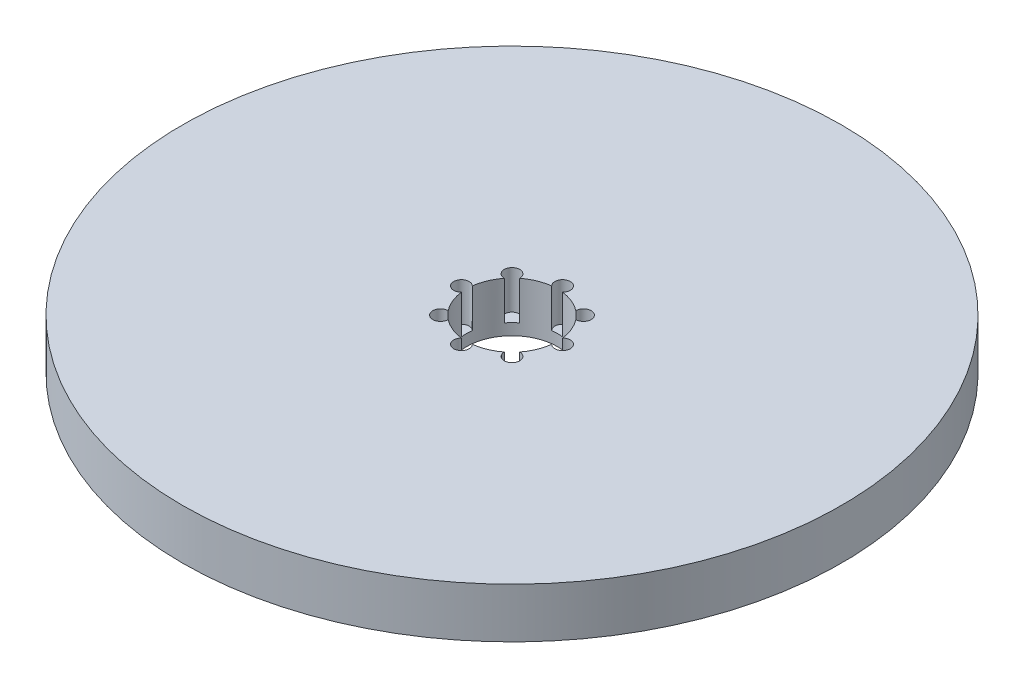
ISO-10303-21;
HEADER;
FILE_DESCRIPTION(('STEP AP214'),'2;1');
FILE_NAME('part.step','',(''),(''),'','','');
FILE_SCHEMA(('AUTOMOTIVE_DESIGN { 1 0 10303 214 1 1 1 1 }'));
ENDSEC;
DATA;
#1=APPLICATION_CONTEXT('core data for automotive mechanical design processes');
#2=APPLICATION_PROTOCOL_DEFINITION('international standard','automotive_design',2000,#1);
#3=PRODUCT_CONTEXT('',#1,'mechanical');
#4=PRODUCT('Part','Part','',(#3));
#5=PRODUCT_RELATED_PRODUCT_CATEGORY('part','',(#4));
#6=PRODUCT_DEFINITION_FORMATION('','',#4);
#7=PRODUCT_DEFINITION_CONTEXT('part definition',#1,'design');
#8=PRODUCT_DEFINITION('design','',#6,#7);
#9=PRODUCT_DEFINITION_SHAPE('','',#8);
#10=(LENGTH_UNIT() NAMED_UNIT(*) SI_UNIT(.MILLI.,.METRE.));
#11=(NAMED_UNIT(*) PLANE_ANGLE_UNIT() SI_UNIT($,.RADIAN.));
#12=(NAMED_UNIT(*) SI_UNIT($,.STERADIAN.) SOLID_ANGLE_UNIT());
#13=UNCERTAINTY_MEASURE_WITH_UNIT(LENGTH_MEASURE(1.E-05),#10,'distance_accuracy_value','');
#14=(GEOMETRIC_REPRESENTATION_CONTEXT(3) GLOBAL_UNCERTAINTY_ASSIGNED_CONTEXT((#13)) GLOBAL_UNIT_ASSIGNED_CONTEXT((#10,
#11,#12)) REPRESENTATION_CONTEXT('',''));
#15=CARTESIAN_POINT('',(0.,0.,0.));
#16=DIRECTION('',(0.,0.,1.));
#17=DIRECTION('',(1.,0.,0.));
#18=AXIS2_PLACEMENT_3D('',#15,#16,#17);
#19=CARTESIAN_POINT('',(0.,11.,0.));
#20=DIRECTION('',(0.,-1.,0.));
#21=DIRECTION('',(0.,0.,-1.));
#22=AXIS2_PLACEMENT_3D('',#19,#20,#21);
#23=CYLINDRICAL_SURFACE('',#22,72.5);
#24=CARTESIAN_POINT('',(0.,11.,0.));
#25=DIRECTION('',(0.,1.,0.));
#26=DIRECTION('',(0.,0.,1.));
#27=AXIS2_PLACEMENT_3D('',#24,#25,#26);
#28=CIRCLE('',#27,72.5);
#29=CARTESIAN_POINT('',(0.,11.,72.5));
#30=VERTEX_POINT('',#29);
#31=EDGE_CURVE('E195',#30,#30,#28,.T.);
#32=ORIENTED_EDGE('',*,*,#31,.F.);
#33=EDGE_LOOP('',(#32));
#34=FACE_BOUND('',#33,.T.);
#35=CARTESIAN_POINT('',(0.,0.,0.));
#36=DIRECTION('',(0.,1.,0.));
#37=DIRECTION('',(0.,0.,1.));
#38=AXIS2_PLACEMENT_3D('',#35,#36,#37);
#39=CIRCLE('',#38,72.5);
#40=CARTESIAN_POINT('',(0.,0.,72.5));
#41=VERTEX_POINT('',#40);
#42=EDGE_CURVE('E179',#41,#41,#39,.T.);
#43=ORIENTED_EDGE('',*,*,#42,.T.);
#44=EDGE_LOOP('',(#43));
#45=FACE_BOUND('',#44,.T.);
#46=ADVANCED_FACE('F39',(#34,#45),#23,.T.);
#47=CARTESIAN_POINT('',(0.,11.,0.));
#48=DIRECTION('',(0.,1.,0.));
#49=DIRECTION('',(0.,0.,1.));
#50=AXIS2_PLACEMENT_3D('',#47,#48,#49);
#51=PLANE('',#50);
#52=CARTESIAN_POINT('',(0.,11.,11.1252971700973));
#53=DIRECTION('',(0.,1.,0.));
#54=DIRECTION('',(1.,0.,0.));
#55=AXIS2_PLACEMENT_3D('',#52,#53,#54);
#56=CIRCLE('',#55,1.69382109082511);
#57=CARTESIAN_POINT('',(-1.19809630362251,11.,9.92796883794697));
#58=VERTEX_POINT('',#57);
#59=CARTESIAN_POINT('',(1.19809630362258,11.,9.92796883794696));
#60=VERTEX_POINT('',#59);
#61=EDGE_CURVE('E176',#58,#60,#56,.T.);
#62=ORIENTED_EDGE('',*,*,#61,.F.);
#63=CARTESIAN_POINT('',(0.,11.,0.));
#64=DIRECTION('',(0.,1.,0.));
#65=DIRECTION('',(0.,0.,1.));
#66=AXIS2_PLACEMENT_3D('',#63,#64,#65);
#67=CIRCLE('',#66,10.);
#68=CARTESIAN_POINT('',(-6.17295206791497,11.,7.86731610952708));
#69=VERTEX_POINT('',#68);
#70=EDGE_CURVE('E166',#69,#58,#67,.T.);
#71=ORIENTED_EDGE('',*,*,#70,.F.);
#72=CARTESIAN_POINT('',(-7.86677307169131,11.,7.86677307169134));
#73=DIRECTION('',(0.,1.,0.));
#74=DIRECTION('',(0.707106781186549,0.,0.707106781186546));
#75=AXIS2_PLACEMENT_3D('',#72,#73,#74);
#76=CIRCLE('',#75,1.69382109082511);
#77=CARTESIAN_POINT('',(-7.86731610952705,11.,6.172952067915));
#78=VERTEX_POINT('',#77);
#79=EDGE_CURVE('E147',#78,#69,#76,.T.);
#80=ORIENTED_EDGE('',*,*,#79,.F.);
#81=CARTESIAN_POINT('',(-9.92796883794696,11.,1.19809630362255));
#82=VERTEX_POINT('',#81);
#83=EDGE_CURVE('E180',#82,#78,#67,.T.);
#84=ORIENTED_EDGE('',*,*,#83,.F.);
#85=CARTESIAN_POINT('',(-11.1252971700973,11.,0.));
#86=DIRECTION('',(0.,1.,0.));
#87=DIRECTION('',(0.,0.,1.));
#88=AXIS2_PLACEMENT_3D('',#85,#86,#87);
#89=CIRCLE('',#88,1.69382109082511);
#90=CARTESIAN_POINT('',(-9.92796883794696,11.,-1.19809630362255));
#91=VERTEX_POINT('',#90);
#92=EDGE_CURVE('E186',#91,#82,#89,.T.);
#93=ORIENTED_EDGE('',*,*,#92,.F.);
#94=CARTESIAN_POINT('',(-7.86731610952715,11.,-6.17295206791489));
#95=VERTEX_POINT('',#94);
#96=EDGE_CURVE('E182',#95,#91,#67,.T.);
#97=ORIENTED_EDGE('',*,*,#96,.F.);
#98=CARTESIAN_POINT('',(-7.86677307169142,11.,-7.86677307169123));
#99=DIRECTION('',(0.,1.,0.));
#100=DIRECTION('',(-0.707106781186539,0.,0.707106781186556));
#101=AXIS2_PLACEMENT_3D('',#98,#99,#100);
#102=CIRCLE('',#101,1.69382109082511);
#103=CARTESIAN_POINT('',(-6.17295206791508,11.,-7.86731610952699));
#104=VERTEX_POINT('',#103);
#105=EDGE_CURVE('E446',#104,#95,#102,.T.);
#106=ORIENTED_EDGE('',*,*,#105,.F.);
#107=CARTESIAN_POINT('',(-1.19809630362265,11.,-9.92796883794695));
#108=VERTEX_POINT('',#107);
#109=EDGE_CURVE('E452',#108,#104,#67,.T.);
#110=ORIENTED_EDGE('',*,*,#109,.F.);
#111=CARTESIAN_POINT('',(-1.16531302375437E-13,11.,-11.1252971700973));
#112=DIRECTION('',(0.,1.,0.));
#113=DIRECTION('',(-1.,0.,0.));
#114=AXIS2_PLACEMENT_3D('',#111,#112,#113);
#115=CIRCLE('',#114,1.69382109082511);
#116=CARTESIAN_POINT('',(1.19809630362245,11.,-9.92796883794698));
#117=VERTEX_POINT('',#116);
#118=EDGE_CURVE('E477',#117,#108,#115,.T.);
#119=ORIENTED_EDGE('',*,*,#118,.F.);
#120=CARTESIAN_POINT('',(6.17295206791492,11.,-7.86731610952712));
#121=VERTEX_POINT('',#120);
#122=EDGE_CURVE('E460',#121,#117,#67,.T.);
#123=ORIENTED_EDGE('',*,*,#122,.F.);
#124=CARTESIAN_POINT('',(7.86677307169126,11.,-7.86677307169139));
#125=DIRECTION('',(0.,1.,0.));
#126=DIRECTION('',(-0.707106781186554,0.,-0.707106781186541));
#127=AXIS2_PLACEMENT_3D('',#124,#125,#126);
#128=CIRCLE('',#127,1.69382109082511);
#129=CARTESIAN_POINT('',(7.86731610952701,11.,-6.17295206791505));
#130=VERTEX_POINT('',#129);
#131=EDGE_CURVE('E464',#130,#121,#128,.T.);
#132=ORIENTED_EDGE('',*,*,#131,.F.);
#133=CARTESIAN_POINT('',(9.92796883794696,11.,-1.19809630362255));
#134=VERTEX_POINT('',#133);
#135=EDGE_CURVE('E459',#134,#130,#67,.T.);
#136=ORIENTED_EDGE('',*,*,#135,.F.);
#137=CARTESIAN_POINT('',(11.1252971700973,11.,0.));
#138=DIRECTION('',(0.,1.,0.));
#139=DIRECTION('',(0.,0.,-1.));
#140=AXIS2_PLACEMENT_3D('',#137,#138,#139);
#141=CIRCLE('',#140,1.69382109082511);
#142=CARTESIAN_POINT('',(9.92796883794696,11.,1.19809630362255));
#143=VERTEX_POINT('',#142);
#144=EDGE_CURVE('E469',#143,#134,#141,.T.);
#145=ORIENTED_EDGE('',*,*,#144,.F.);
#146=CARTESIAN_POINT('',(7.8673161095271,11.,6.17295206791494));
#147=VERTEX_POINT('',#146);
#148=EDGE_CURVE('E181',#147,#143,#67,.T.);
#149=ORIENTED_EDGE('',*,*,#148,.F.);
#150=CARTESIAN_POINT('',(7.86677307169137,11.,7.86677307169128));
#151=DIRECTION('',(0.,1.,0.));
#152=DIRECTION('',(0.707106781186544,0.,-0.707106781186551));
#153=AXIS2_PLACEMENT_3D('',#150,#151,#152);
#154=CIRCLE('',#153,1.69382109082511);
#155=CARTESIAN_POINT('',(6.17295206791503,11.,7.86731610952704));
#156=VERTEX_POINT('',#155);
#157=EDGE_CURVE('E475',#156,#147,#154,.T.);
#158=ORIENTED_EDGE('',*,*,#157,.F.);
#159=EDGE_CURVE('E177',#60,#156,#67,.T.);
#160=ORIENTED_EDGE('',*,*,#159,.F.);
#161=EDGE_LOOP('',(#62,#71,#80,#84,#93,#97,#106,#110,#119,#123,#132,#136,#145,#149,#158,#160));
#162=FACE_BOUND('',#161,.T.);
#163=ORIENTED_EDGE('',*,*,#31,.T.);
#164=EDGE_LOOP('',(#163));
#165=FACE_BOUND('',#164,.T.);
#166=ADVANCED_FACE('F172',(#162,#165),#51,.T.);
#167=CARTESIAN_POINT('',(0.,0.,0.));
#168=DIRECTION('',(0.,1.,0.));
#169=DIRECTION('',(0.,0.,1.));
#170=AXIS2_PLACEMENT_3D('',#167,#168,#169);
#171=PLANE('',#170);
#172=CARTESIAN_POINT('',(0.,0.,0.));
#173=DIRECTION('',(0.,1.,0.));
#174=DIRECTION('',(0.,0.,1.));
#175=AXIS2_PLACEMENT_3D('',#172,#173,#174);
#176=CIRCLE('',#175,10.);
#177=CARTESIAN_POINT('',(0.,0.,10.));
#178=VERTEX_POINT('',#177);
#179=EDGE_CURVE('E187',#178,#178,#176,.T.);
#180=ORIENTED_EDGE('',*,*,#179,.T.);
#181=EDGE_LOOP('',(#180));
#182=FACE_BOUND('',#181,.T.);
#183=ORIENTED_EDGE('',*,*,#42,.F.);
#184=EDGE_LOOP('',(#183));
#185=FACE_BOUND('',#184,.T.);
#186=ADVANCED_FACE('F270',(#182,#185),#171,.F.);
#187=CARTESIAN_POINT('',(0.,11.,0.));
#188=DIRECTION('',(0.,-1.,0.));
#189=DIRECTION('',(0.,0.,-1.));
#190=AXIS2_PLACEMENT_3D('',#187,#188,#189);
#191=CYLINDRICAL_SURFACE('',#190,10.);
#192=DIRECTION('',(0.,1.,0.));
#193=VECTOR('',#192,1.);
#194=CARTESIAN_POINT('',(-1.19809630362251,6.75119234254863,9.92796883794697));
#195=LINE('',#194,#193);
#196=CARTESIAN_POINT('',(-1.19809630362251,2.50238468509725,9.92796883794697));
#197=VERTEX_POINT('',#196);
#198=EDGE_CURVE('E11',#197,#58,#195,.T.);
#199=ORIENTED_EDGE('',*,*,#198,.F.);
#200=CARTESIAN_POINT('',(0.,2.50238468509725,0.));
#201=DIRECTION('',(0.,1.,0.));
#202=DIRECTION('',(0.,0.,1.));
#203=AXIS2_PLACEMENT_3D('',#200,#201,#202);
#204=CIRCLE('',#203,10.);
#205=CARTESIAN_POINT('',(1.19809630362258,2.50238468509725,9.92796883794696));
#206=VERTEX_POINT('',#205);
#207=EDGE_CURVE('E250',#197,#206,#204,.T.);
#208=ORIENTED_EDGE('',*,*,#207,.T.);
#209=DIRECTION('',(0.,1.,0.));
#210=VECTOR('',#209,1.);
#211=CARTESIAN_POINT('',(1.19809630362258,6.75119234254863,9.92796883794696));
#212=LINE('',#211,#210);
#213=EDGE_CURVE('E46',#60,#206,#212,.F.);
#214=ORIENTED_EDGE('',*,*,#213,.F.);
#215=ORIENTED_EDGE('',*,*,#159,.T.);
#216=DIRECTION('',(0.,1.,0.));
#217=VECTOR('',#216,1.);
#218=CARTESIAN_POINT('',(6.17295206791503,6.75119234254863,7.86731610952703));
#219=LINE('',#218,#217);
#220=CARTESIAN_POINT('',(6.17295206791503,2.50238468509725,7.86731610952704));
#221=VERTEX_POINT('',#220);
#222=EDGE_CURVE('E244',#221,#156,#219,.T.);
#223=ORIENTED_EDGE('',*,*,#222,.F.);
#224=CARTESIAN_POINT('',(0.,2.50238468509725,0.));
#225=DIRECTION('',(0.,1.,0.));
#226=DIRECTION('',(0.,0.,1.));
#227=AXIS2_PLACEMENT_3D('',#224,#225,#226);
#228=CIRCLE('',#227,10.);
#229=CARTESIAN_POINT('',(7.8673161095271,2.50238468509725,6.17295206791494));
#230=VERTEX_POINT('',#229);
#231=EDGE_CURVE('E238',#221,#230,#228,.T.);
#232=ORIENTED_EDGE('',*,*,#231,.T.);
#233=DIRECTION('',(0.,1.,0.));
#234=VECTOR('',#233,1.);
#235=CARTESIAN_POINT('',(7.8673161095271,6.75119234254863,6.17295206791494));
#236=LINE('',#235,#234);
#237=EDGE_CURVE('E242',#147,#230,#236,.F.);
#238=ORIENTED_EDGE('',*,*,#237,.F.);
#239=ORIENTED_EDGE('',*,*,#148,.T.);
#240=DIRECTION('',(0.,1.,0.));
#241=VECTOR('',#240,1.);
#242=CARTESIAN_POINT('',(9.92796883794696,6.75119234254863,1.19809630362255));
#243=LINE('',#242,#241);
#244=CARTESIAN_POINT('',(9.92796883794696,2.50238468509725,1.19809630362255));
#245=VERTEX_POINT('',#244);
#246=EDGE_CURVE('E236',#245,#143,#243,.T.);
#247=ORIENTED_EDGE('',*,*,#246,.F.);
#248=CARTESIAN_POINT('',(0.,2.50238468509725,0.));
#249=DIRECTION('',(0.,1.,0.));
#250=DIRECTION('',(0.,0.,1.));
#251=AXIS2_PLACEMENT_3D('',#248,#249,#250);
#252=CIRCLE('',#251,10.);
#253=CARTESIAN_POINT('',(9.92796883794696,2.50238468509725,-1.19809630362255));
#254=VERTEX_POINT('',#253);
#255=EDGE_CURVE('E235',#245,#254,#252,.T.);
#256=ORIENTED_EDGE('',*,*,#255,.T.);
#257=DIRECTION('',(0.,1.,0.));
#258=VECTOR('',#257,1.);
#259=CARTESIAN_POINT('',(9.92796883794696,6.75119234254863,-1.19809630362255));
#260=LINE('',#259,#258);
#261=EDGE_CURVE('E234',#134,#254,#260,.F.);
#262=ORIENTED_EDGE('',*,*,#261,.F.);
#263=ORIENTED_EDGE('',*,*,#135,.T.);
#264=DIRECTION('',(0.,1.,0.));
#265=VECTOR('',#264,1.);
#266=CARTESIAN_POINT('',(7.86731610952701,6.75119234254863,-6.17295206791505));
#267=LINE('',#266,#265);
#268=CARTESIAN_POINT('',(7.86731610952701,2.50238468509725,-6.17295206791505));
#269=VERTEX_POINT('',#268);
#270=EDGE_CURVE('E229',#269,#130,#267,.T.);
#271=ORIENTED_EDGE('',*,*,#270,.F.);
#272=CARTESIAN_POINT('',(0.,2.50238468509725,0.));
#273=DIRECTION('',(0.,1.,0.));
#274=DIRECTION('',(0.,0.,1.));
#275=AXIS2_PLACEMENT_3D('',#272,#273,#274);
#276=CIRCLE('',#275,10.);
#277=CARTESIAN_POINT('',(6.17295206791492,2.50238468509725,-7.86731610952712));
#278=VERTEX_POINT('',#277);
#279=EDGE_CURVE('E221',#269,#278,#276,.T.);
#280=ORIENTED_EDGE('',*,*,#279,.T.);
#281=DIRECTION('',(0.,1.,0.));
#282=VECTOR('',#281,1.);
#283=CARTESIAN_POINT('',(6.17295206791492,6.75119234254863,-7.86731610952712));
#284=LINE('',#283,#282);
#285=EDGE_CURVE('E230',#121,#278,#284,.F.);
#286=ORIENTED_EDGE('',*,*,#285,.F.);
#287=ORIENTED_EDGE('',*,*,#122,.T.);
#288=DIRECTION('',(0.,1.,0.));
#289=VECTOR('',#288,1.);
#290=CARTESIAN_POINT('',(1.19809630362244,6.75119234254863,-9.92796883794697));
#291=LINE('',#290,#289);
#292=CARTESIAN_POINT('',(1.19809630362245,2.50238468509725,-9.92796883794698));
#293=VERTEX_POINT('',#292);
#294=EDGE_CURVE('E225',#293,#117,#291,.T.);
#295=ORIENTED_EDGE('',*,*,#294,.F.);
#296=CARTESIAN_POINT('',(0.,2.50238468509725,0.));
#297=DIRECTION('',(0.,1.,0.));
#298=DIRECTION('',(0.,0.,1.));
#299=AXIS2_PLACEMENT_3D('',#296,#297,#298);
#300=CIRCLE('',#299,10.);
#301=CARTESIAN_POINT('',(-1.19809630362265,2.50238468509725,-9.92796883794695));
#302=VERTEX_POINT('',#301);
#303=EDGE_CURVE('E216',#293,#302,#300,.T.);
#304=ORIENTED_EDGE('',*,*,#303,.T.);
#305=DIRECTION('',(0.,1.,0.));
#306=VECTOR('',#305,1.);
#307=CARTESIAN_POINT('',(-1.19809630362265,6.75119234254863,-9.92796883794695));
#308=LINE('',#307,#306);
#309=EDGE_CURVE('E218',#108,#302,#308,.F.);
#310=ORIENTED_EDGE('',*,*,#309,.F.);
#311=ORIENTED_EDGE('',*,*,#109,.T.);
#312=DIRECTION('',(0.,1.,0.));
#313=VECTOR('',#312,1.);
#314=CARTESIAN_POINT('',(-6.17295206791508,6.75119234254863,-7.86731610952699));
#315=LINE('',#314,#313);
#316=CARTESIAN_POINT('',(-6.17295206791508,2.50238468509725,-7.86731610952699));
#317=VERTEX_POINT('',#316);
#318=EDGE_CURVE('E212',#317,#104,#315,.T.);
#319=ORIENTED_EDGE('',*,*,#318,.F.);
#320=CARTESIAN_POINT('',(0.,2.50238468509725,0.));
#321=DIRECTION('',(0.,1.,0.));
#322=DIRECTION('',(0.,0.,1.));
#323=AXIS2_PLACEMENT_3D('',#320,#321,#322);
#324=CIRCLE('',#323,10.);
#325=CARTESIAN_POINT('',(-7.86731610952715,2.50238468509725,-6.17295206791489));
#326=VERTEX_POINT('',#325);
#327=EDGE_CURVE('E208',#317,#326,#324,.T.);
#328=ORIENTED_EDGE('',*,*,#327,.T.);
#329=DIRECTION('',(0.,1.,0.));
#330=VECTOR('',#329,1.);
#331=CARTESIAN_POINT('',(-7.86731610952714,6.75119234254863,-6.17295206791489));
#332=LINE('',#331,#330);
#333=EDGE_CURVE('E211',#95,#326,#332,.F.);
#334=ORIENTED_EDGE('',*,*,#333,.F.);
#335=ORIENTED_EDGE('',*,*,#96,.T.);
#336=DIRECTION('',(0.,1.,0.));
#337=VECTOR('',#336,1.);
#338=CARTESIAN_POINT('',(-9.92796883794696,6.75119234254863,-1.19809630362255));
#339=LINE('',#338,#337);
#340=CARTESIAN_POINT('',(-9.92796883794696,2.50238468509725,-1.19809630362255));
#341=VERTEX_POINT('',#340);
#342=EDGE_CURVE('E201',#341,#91,#339,.T.);
#343=ORIENTED_EDGE('',*,*,#342,.F.);
#344=CARTESIAN_POINT('',(0.,2.50238468509725,0.));
#345=DIRECTION('',(0.,1.,0.));
#346=DIRECTION('',(0.,0.,1.));
#347=AXIS2_PLACEMENT_3D('',#344,#345,#346);
#348=CIRCLE('',#347,10.);
#349=CARTESIAN_POINT('',(-9.92796883794696,2.50238468509725,1.19809630362255));
#350=VERTEX_POINT('',#349);
#351=EDGE_CURVE('E194',#341,#350,#348,.T.);
#352=ORIENTED_EDGE('',*,*,#351,.T.);
#353=DIRECTION('',(0.,1.,0.));
#354=VECTOR('',#353,1.);
#355=CARTESIAN_POINT('',(-9.92796883794696,6.75119234254863,1.19809630362255));
#356=LINE('',#355,#354);
#357=EDGE_CURVE('E199',#82,#350,#356,.F.);
#358=ORIENTED_EDGE('',*,*,#357,.F.);
#359=ORIENTED_EDGE('',*,*,#83,.T.);
#360=DIRECTION('',(0.,1.,0.));
#361=VECTOR('',#360,1.);
#362=CARTESIAN_POINT('',(-7.86731610952706,6.75119234254863,6.172952067915));
#363=LINE('',#362,#361);
#364=CARTESIAN_POINT('',(-7.86731610952705,2.50238468509725,6.172952067915));
#365=VERTEX_POINT('',#364);
#366=EDGE_CURVE('E160',#365,#78,#363,.T.);
#367=ORIENTED_EDGE('',*,*,#366,.F.);
#368=CARTESIAN_POINT('',(0.,2.50238468509725,0.));
#369=DIRECTION('',(0.,1.,0.));
#370=DIRECTION('',(0.,0.,1.));
#371=AXIS2_PLACEMENT_3D('',#368,#369,#370);
#372=CIRCLE('',#371,10.);
#373=CARTESIAN_POINT('',(-6.17295206791497,2.50238468509725,7.86731610952708));
#374=VERTEX_POINT('',#373);
#375=EDGE_CURVE('E168',#365,#374,#372,.T.);
#376=ORIENTED_EDGE('',*,*,#375,.T.);
#377=DIRECTION('',(0.,1.,0.));
#378=VECTOR('',#377,1.);
#379=CARTESIAN_POINT('',(-6.17295206791497,6.75119234254863,7.86731610952708));
#380=LINE('',#379,#378);
#381=EDGE_CURVE('E152',#69,#374,#380,.F.);
#382=ORIENTED_EDGE('',*,*,#381,.F.);
#383=ORIENTED_EDGE('',*,*,#70,.T.);
#384=EDGE_LOOP('',(#199,#208,#214,#215,#223,#232,#238,#239,#247,#256,#262,#263,#271,#280,#286,
#287,#295,#304,#310,#311,#319,#328,#334,#335,#343,#352,#358,#359,#367,#376,#382,#383));
#385=FACE_BOUND('',#384,.T.);
#386=ORIENTED_EDGE('',*,*,#179,.F.);
#387=EDGE_LOOP('',(#386));
#388=FACE_BOUND('',#387,.T.);
#389=ADVANCED_FACE('F170',(#385,#388),#191,.F.);
#390=CARTESIAN_POINT('',(-11.1252971700973,2.50238468509725,0.));
#391=DIRECTION('',(0.,1.,0.));
#392=DIRECTION('',(0.,0.,1.));
#393=AXIS2_PLACEMENT_3D('',#390,#391,#392);
#394=CYLINDRICAL_SURFACE('',#393,1.69382109082511);
#395=ORIENTED_EDGE('',*,*,#342,.T.);
#396=ORIENTED_EDGE('',*,*,#92,.T.);
#397=ORIENTED_EDGE('',*,*,#357,.T.);
#398=CARTESIAN_POINT('',(-11.1252971700973,2.50238468509725,0.));
#399=DIRECTION('',(0.,1.,0.));
#400=DIRECTION('',(0.,0.,1.));
#401=AXIS2_PLACEMENT_3D('',#398,#399,#400);
#402=CIRCLE('',#401,1.69382109082511);
#403=EDGE_CURVE('E191',#341,#350,#402,.T.);
#404=ORIENTED_EDGE('',*,*,#403,.F.);
#405=EDGE_LOOP('',(#395,#396,#397,#404));
#406=FACE_BOUND('',#405,.T.);
#407=ADVANCED_FACE('F279',(#406),#394,.F.);
#408=CARTESIAN_POINT('',(-11.1252971700973,2.50238468509725,0.));
#409=DIRECTION('',(0.,1.,0.));
#410=DIRECTION('',(0.,0.,1.));
#411=AXIS2_PLACEMENT_3D('',#408,#409,#410);
#412=PLANE('',#411);
#413=ORIENTED_EDGE('',*,*,#403,.T.);
#414=ORIENTED_EDGE('',*,*,#351,.F.);
#415=EDGE_LOOP('',(#413,#414));
#416=FACE_BOUND('',#415,.T.);
#417=ADVANCED_FACE('F285',(#416),#412,.T.);
#418=CARTESIAN_POINT('',(-7.86677307169131,2.50238468509725,7.86677307169134));
#419=DIRECTION('',(0.,1.,0.));
#420=DIRECTION('',(0.,0.,1.));
#421=AXIS2_PLACEMENT_3D('',#418,#419,#420);
#422=CYLINDRICAL_SURFACE('',#421,1.69382109082511);
#423=ORIENTED_EDGE('',*,*,#366,.T.);
#424=ORIENTED_EDGE('',*,*,#79,.T.);
#425=ORIENTED_EDGE('',*,*,#381,.T.);
#426=CARTESIAN_POINT('',(-7.86677307169131,2.50238468509725,7.86677307169134));
#427=DIRECTION('',(0.,1.,0.));
#428=DIRECTION('',(0.707106781186549,0.,0.707106781186546));
#429=AXIS2_PLACEMENT_3D('',#426,#427,#428);
#430=CIRCLE('',#429,1.69382109082511);
#431=EDGE_CURVE('E165',#365,#374,#430,.T.);
#432=ORIENTED_EDGE('',*,*,#431,.F.);
#433=EDGE_LOOP('',(#423,#424,#425,#432));
#434=FACE_BOUND('',#433,.T.);
#435=ADVANCED_FACE('F155',(#434),#422,.F.);
#436=CARTESIAN_POINT('',(-7.86677307169131,2.50238468509725,7.86677307169134));
#437=DIRECTION('',(0.,1.,0.));
#438=DIRECTION('',(0.707106781186549,0.,0.707106781186546));
#439=AXIS2_PLACEMENT_3D('',#436,#437,#438);
#440=PLANE('',#439);
#441=ORIENTED_EDGE('',*,*,#431,.T.);
#442=ORIENTED_EDGE('',*,*,#375,.F.);
#443=EDGE_LOOP('',(#441,#442));
#444=FACE_BOUND('',#443,.T.);
#445=ADVANCED_FACE('F288',(#444),#440,.T.);
#446=CARTESIAN_POINT('',(-7.86677307169142,2.50238468509725,-7.86677307169123));
#447=DIRECTION('',(0.,1.,0.));
#448=DIRECTION('',(0.,0.,1.));
#449=AXIS2_PLACEMENT_3D('',#446,#447,#448);
#450=CYLINDRICAL_SURFACE('',#449,1.69382109082511);
#451=ORIENTED_EDGE('',*,*,#318,.T.);
#452=ORIENTED_EDGE('',*,*,#105,.T.);
#453=ORIENTED_EDGE('',*,*,#333,.T.);
#454=CARTESIAN_POINT('',(-7.86677307169142,2.50238468509725,-7.86677307169123));
#455=DIRECTION('',(0.,1.,0.));
#456=DIRECTION('',(-0.707106781186539,0.,0.707106781186556));
#457=AXIS2_PLACEMENT_3D('',#454,#455,#456);
#458=CIRCLE('',#457,1.69382109082511);
#459=EDGE_CURVE('E447',#317,#326,#458,.T.);
#460=ORIENTED_EDGE('',*,*,#459,.F.);
#461=EDGE_LOOP('',(#451,#452,#453,#460));
#462=FACE_BOUND('',#461,.T.);
#463=ADVANCED_FACE('F295',(#462),#450,.F.);
#464=CARTESIAN_POINT('',(-7.86677307169142,2.50238468509725,-7.86677307169123));
#465=DIRECTION('',(0.,1.,0.));
#466=DIRECTION('',(-0.707106781186539,0.,0.707106781186556));
#467=AXIS2_PLACEMENT_3D('',#464,#465,#466);
#468=PLANE('',#467);
#469=ORIENTED_EDGE('',*,*,#459,.T.);
#470=ORIENTED_EDGE('',*,*,#327,.F.);
#471=EDGE_LOOP('',(#469,#470));
#472=FACE_BOUND('',#471,.T.);
#473=ADVANCED_FACE('F375',(#472),#468,.T.);
#474=CARTESIAN_POINT('',(-1.16531302375437E-13,2.50238468509725,-11.1252971700973));
#475=DIRECTION('',(0.,1.,0.));
#476=DIRECTION('',(0.,0.,1.));
#477=AXIS2_PLACEMENT_3D('',#474,#475,#476);
#478=CYLINDRICAL_SURFACE('',#477,1.69382109082511);
#479=ORIENTED_EDGE('',*,*,#294,.T.);
#480=ORIENTED_EDGE('',*,*,#118,.T.);
#481=ORIENTED_EDGE('',*,*,#309,.T.);
#482=CARTESIAN_POINT('',(-1.16531302375437E-13,2.50238468509725,-11.1252971700973));
#483=DIRECTION('',(0.,1.,0.));
#484=DIRECTION('',(-1.,0.,0.));
#485=AXIS2_PLACEMENT_3D('',#482,#483,#484);
#486=CIRCLE('',#485,1.69382109082511);
#487=EDGE_CURVE('E467',#293,#302,#486,.T.);
#488=ORIENTED_EDGE('',*,*,#487,.F.);
#489=EDGE_LOOP('',(#479,#480,#481,#488));
#490=FACE_BOUND('',#489,.T.);
#491=ADVANCED_FACE('F361',(#490),#478,.F.);
#492=CARTESIAN_POINT('',(-1.16531302375437E-13,2.50238468509725,-11.1252971700973));
#493=DIRECTION('',(0.,1.,0.));
#494=DIRECTION('',(-1.,0.,0.));
#495=AXIS2_PLACEMENT_3D('',#492,#493,#494);
#496=PLANE('',#495);
#497=ORIENTED_EDGE('',*,*,#487,.T.);
#498=ORIENTED_EDGE('',*,*,#303,.F.);
#499=EDGE_LOOP('',(#497,#498));
#500=FACE_BOUND('',#499,.T.);
#501=ADVANCED_FACE('F297',(#500),#496,.T.);
#502=CARTESIAN_POINT('',(7.86677307169126,2.50238468509725,-7.86677307169139));
#503=DIRECTION('',(0.,1.,0.));
#504=DIRECTION('',(0.,0.,1.));
#505=AXIS2_PLACEMENT_3D('',#502,#503,#504);
#506=CYLINDRICAL_SURFACE('',#505,1.69382109082511);
#507=ORIENTED_EDGE('',*,*,#270,.T.);
#508=ORIENTED_EDGE('',*,*,#131,.T.);
#509=ORIENTED_EDGE('',*,*,#285,.T.);
#510=CARTESIAN_POINT('',(7.86677307169126,2.50238468509725,-7.86677307169139));
#511=DIRECTION('',(0.,1.,0.));
#512=DIRECTION('',(-0.707106781186554,0.,-0.707106781186541));
#513=AXIS2_PLACEMENT_3D('',#510,#511,#512);
#514=CIRCLE('',#513,1.69382109082511);
#515=EDGE_CURVE('E470',#269,#278,#514,.T.);
#516=ORIENTED_EDGE('',*,*,#515,.F.);
#517=EDGE_LOOP('',(#507,#508,#509,#516));
#518=FACE_BOUND('',#517,.T.);
#519=ADVANCED_FACE('F294',(#518),#506,.F.);
#520=CARTESIAN_POINT('',(7.86677307169126,2.50238468509725,-7.86677307169139));
#521=DIRECTION('',(0.,1.,0.));
#522=DIRECTION('',(-0.707106781186554,0.,-0.707106781186541));
#523=AXIS2_PLACEMENT_3D('',#520,#521,#522);
#524=PLANE('',#523);
#525=ORIENTED_EDGE('',*,*,#515,.T.);
#526=ORIENTED_EDGE('',*,*,#279,.F.);
#527=EDGE_LOOP('',(#525,#526));
#528=FACE_BOUND('',#527,.T.);
#529=ADVANCED_FACE('F300',(#528),#524,.T.);
#530=CARTESIAN_POINT('',(11.1252971700973,2.50238468509725,0.));
#531=DIRECTION('',(0.,1.,0.));
#532=DIRECTION('',(0.,0.,1.));
#533=AXIS2_PLACEMENT_3D('',#530,#531,#532);
#534=CYLINDRICAL_SURFACE('',#533,1.69382109082511);
#535=ORIENTED_EDGE('',*,*,#246,.T.);
#536=ORIENTED_EDGE('',*,*,#144,.T.);
#537=ORIENTED_EDGE('',*,*,#261,.T.);
#538=CARTESIAN_POINT('',(11.1252971700973,2.50238468509725,0.));
#539=DIRECTION('',(0.,1.,0.));
#540=DIRECTION('',(0.,0.,-1.));
#541=AXIS2_PLACEMENT_3D('',#538,#539,#540);
#542=CIRCLE('',#541,1.69382109082511);
#543=EDGE_CURVE('E472',#245,#254,#542,.T.);
#544=ORIENTED_EDGE('',*,*,#543,.F.);
#545=EDGE_LOOP('',(#535,#536,#537,#544));
#546=FACE_BOUND('',#545,.T.);
#547=ADVANCED_FACE('F305',(#546),#534,.F.);
#548=CARTESIAN_POINT('',(11.1252971700973,2.50238468509725,0.));
#549=DIRECTION('',(0.,1.,0.));
#550=DIRECTION('',(0.,0.,-1.));
#551=AXIS2_PLACEMENT_3D('',#548,#549,#550);
#552=PLANE('',#551);
#553=ORIENTED_EDGE('',*,*,#543,.T.);
#554=ORIENTED_EDGE('',*,*,#255,.F.);
#555=EDGE_LOOP('',(#553,#554));
#556=FACE_BOUND('',#555,.T.);
#557=ADVANCED_FACE('F308',(#556),#552,.T.);
#558=CARTESIAN_POINT('',(7.86677307169137,2.50238468509725,7.86677307169128));
#559=DIRECTION('',(0.,1.,0.));
#560=DIRECTION('',(0.,0.,1.));
#561=AXIS2_PLACEMENT_3D('',#558,#559,#560);
#562=CYLINDRICAL_SURFACE('',#561,1.69382109082511);
#563=ORIENTED_EDGE('',*,*,#222,.T.);
#564=ORIENTED_EDGE('',*,*,#157,.T.);
#565=ORIENTED_EDGE('',*,*,#237,.T.);
#566=CARTESIAN_POINT('',(7.86677307169137,2.50238468509725,7.86677307169128));
#567=DIRECTION('',(0.,1.,0.));
#568=DIRECTION('',(0.707106781186544,0.,-0.707106781186551));
#569=AXIS2_PLACEMENT_3D('',#566,#567,#568);
#570=CIRCLE('',#569,1.69382109082511);
#571=EDGE_CURVE('E56',#221,#230,#570,.T.);
#572=ORIENTED_EDGE('',*,*,#571,.F.);
#573=EDGE_LOOP('',(#563,#564,#565,#572));
#574=FACE_BOUND('',#573,.T.);
#575=ADVANCED_FACE('F309',(#574),#562,.F.);
#576=CARTESIAN_POINT('',(7.86677307169137,2.50238468509725,7.86677307169128));
#577=DIRECTION('',(0.,1.,0.));
#578=DIRECTION('',(0.707106781186544,0.,-0.707106781186551));
#579=AXIS2_PLACEMENT_3D('',#576,#577,#578);
#580=PLANE('',#579);
#581=ORIENTED_EDGE('',*,*,#571,.T.);
#582=ORIENTED_EDGE('',*,*,#231,.F.);
#583=EDGE_LOOP('',(#581,#582));
#584=FACE_BOUND('',#583,.T.);
#585=ADVANCED_FACE('F256',(#584),#580,.T.);
#586=CARTESIAN_POINT('',(0.,2.50238468509725,11.1252971700973));
#587=DIRECTION('',(0.,1.,0.));
#588=DIRECTION('',(0.,0.,1.));
#589=AXIS2_PLACEMENT_3D('',#586,#587,#588);
#590=CYLINDRICAL_SURFACE('',#589,1.69382109082511);
#591=ORIENTED_EDGE('',*,*,#198,.T.);
#592=ORIENTED_EDGE('',*,*,#61,.T.);
#593=ORIENTED_EDGE('',*,*,#213,.T.);
#594=CARTESIAN_POINT('',(0.,2.50238468509725,11.1252971700973));
#595=DIRECTION('',(0.,1.,0.));
#596=DIRECTION('',(1.,0.,0.));
#597=AXIS2_PLACEMENT_3D('',#594,#595,#596);
#598=CIRCLE('',#597,1.69382109082511);
#599=EDGE_CURVE('E55',#197,#206,#598,.T.);
#600=ORIENTED_EDGE('',*,*,#599,.F.);
#601=EDGE_LOOP('',(#591,#592,#593,#600));
#602=FACE_BOUND('',#601,.T.);
#603=ADVANCED_FACE('F253',(#602),#590,.F.);
#604=CARTESIAN_POINT('',(0.,2.50238468509725,11.1252971700973));
#605=DIRECTION('',(0.,1.,0.));
#606=DIRECTION('',(1.,0.,0.));
#607=AXIS2_PLACEMENT_3D('',#604,#605,#606);
#608=PLANE('',#607);
#609=ORIENTED_EDGE('',*,*,#599,.T.);
#610=ORIENTED_EDGE('',*,*,#207,.F.);
#611=EDGE_LOOP('',(#609,#610));
#612=FACE_BOUND('',#611,.T.);
#613=ADVANCED_FACE('F252',(#612),#608,.T.);
#614=CLOSED_SHELL('',(#46,#166,#186,#389,#407,#417,#435,#445,#463,#473,#491,#501,#519,#529,#547,
#557,#575,#585,#603,#613));
#615=MANIFOLD_SOLID_BREP('B2',#614);
#616=ADVANCED_BREP_SHAPE_REPRESENTATION('',(#18,#615),#14);
#617=SHAPE_DEFINITION_REPRESENTATION(#9,#616);
ENDSEC;
END-ISO-10303-21;
